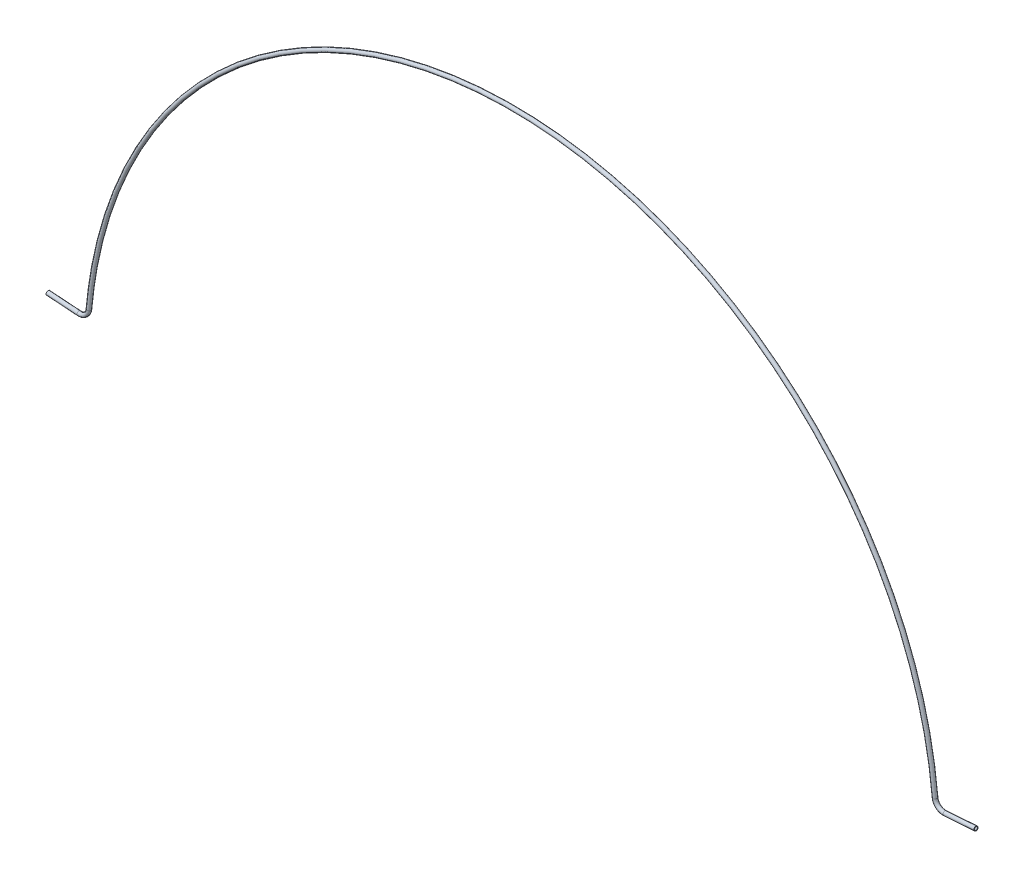
ISO-10303-21;
HEADER;
FILE_DESCRIPTION(('STEP AP214'),'2;1');
FILE_NAME('part.step','',(''),(''),'','','');
FILE_SCHEMA(('AUTOMOTIVE_DESIGN { 1 0 10303 214 1 1 1 1 }'));
ENDSEC;
DATA;
#1=APPLICATION_CONTEXT('core data for automotive mechanical design processes');
#2=APPLICATION_PROTOCOL_DEFINITION('international standard','automotive_design',2000,#1);
#3=PRODUCT_CONTEXT('',#1,'mechanical');
#4=PRODUCT('Part','Part','',(#3));
#5=PRODUCT_RELATED_PRODUCT_CATEGORY('part','',(#4));
#6=PRODUCT_DEFINITION_FORMATION('','',#4);
#7=PRODUCT_DEFINITION_CONTEXT('part definition',#1,'design');
#8=PRODUCT_DEFINITION('design','',#6,#7);
#9=PRODUCT_DEFINITION_SHAPE('','',#8);
#10=(LENGTH_UNIT() NAMED_UNIT(*) SI_UNIT(.MILLI.,.METRE.));
#11=(NAMED_UNIT(*) PLANE_ANGLE_UNIT() SI_UNIT($,.RADIAN.));
#12=(NAMED_UNIT(*) SI_UNIT($,.STERADIAN.) SOLID_ANGLE_UNIT());
#13=UNCERTAINTY_MEASURE_WITH_UNIT(LENGTH_MEASURE(1.E-05),#10,'distance_accuracy_value','');
#14=(GEOMETRIC_REPRESENTATION_CONTEXT(3) GLOBAL_UNCERTAINTY_ASSIGNED_CONTEXT((#13)) GLOBAL_UNIT_ASSIGNED_CONTEXT((#10,
#11,#12)) REPRESENTATION_CONTEXT('',''));
#15=CARTESIAN_POINT('',(0.,0.,0.));
#16=DIRECTION('',(0.,0.,1.));
#17=DIRECTION('',(1.,0.,0.));
#18=AXIS2_PLACEMENT_3D('',#15,#16,#17);
#19=CARTESIAN_POINT('',(512.122941281873,35.8111246069721,0.));
#20=DIRECTION('',(0.997564050259825,0.0697564737441201,0.));
#21=DIRECTION('',(-0.0697564737441187,0.997564050259825,0.));
#22=AXIS2_PLACEMENT_3D('',#19,#20,#21);
#23=CYLINDRICAL_SURFACE('',#22,2.38125000000003);
#24=CARTESIAN_POINT('',(512.122941281873,35.8111246069721,0.));
#25=DIRECTION('',(0.997564050259825,0.0697564737441154,0.));
#26=DIRECTION('',(0.,0.,-1.));
#27=AXIS2_PLACEMENT_3D('',#24,#25,#26);
#28=CIRCLE('',#27,2.38125000000003);
#29=CARTESIAN_POINT('',(512.289048884976,33.4356752122909,0.));
#30=VERTEX_POINT('',#29);
#31=EDGE_CURVE('E55',#30,#30,#28,.T.);
#32=ORIENTED_EDGE('',*,*,#31,.T.);
#33=EDGE_LOOP('',(#32));
#34=FACE_BOUND('',#33,.T.);
#35=CARTESIAN_POINT('',(548.660227642904,38.3660605592659,0.));
#36=DIRECTION('',(0.997564050259825,0.0697564737441154,0.));
#37=DIRECTION('',(0.,0.,-1.));
#38=AXIS2_PLACEMENT_3D('',#35,#36,#37);
#39=CIRCLE('',#38,2.38125000000003);
#40=CARTESIAN_POINT('',(548.660227642904,38.3660605592659,-2.38125000000003));
#41=VERTEX_POINT('',#40);
#42=EDGE_CURVE('E12',#41,#41,#39,.T.);
#43=ORIENTED_EDGE('',*,*,#42,.F.);
#44=EDGE_LOOP('',(#43));
#45=FACE_BOUND('',#44,.T.);
#46=ADVANCED_FACE('F45',(#34,#45),#23,.T.);
#47=CARTESIAN_POINT('',(512.122941281873,35.8111246069721,0.));
#48=DIRECTION('',(0.997564050259825,0.0697564737441201,0.));
#49=DIRECTION('',(-0.0697564737441187,0.997564050259825,0.));
#50=AXIS2_PLACEMENT_3D('',#47,#48,#49);
#51=CYLINDRICAL_SURFACE('',#50,1.67639999999998);
#52=CARTESIAN_POINT('',(512.122941281873,35.8111246069721,0.));
#53=DIRECTION('',(0.997564050259825,0.0697564737441154,0.));
#54=DIRECTION('',(0.,0.,-1.));
#55=AXIS2_PLACEMENT_3D('',#52,#53,#54);
#56=CIRCLE('',#55,1.67639999999998);
#57=CARTESIAN_POINT('',(512.239881034457,34.1388082331166,0.));
#58=VERTEX_POINT('',#57);
#59=EDGE_CURVE('E59',#58,#58,#56,.T.);
#60=ORIENTED_EDGE('',*,*,#59,.F.);
#61=EDGE_LOOP('',(#60));
#62=FACE_BOUND('',#61,.T.);
#63=CARTESIAN_POINT('',(548.660227642904,38.3660605592659,0.));
#64=DIRECTION('',(0.997564050259825,0.0697564737441154,0.));
#65=DIRECTION('',(0.,0.,-1.));
#66=AXIS2_PLACEMENT_3D('',#63,#64,#65);
#67=CIRCLE('',#66,1.67639999999998);
#68=CARTESIAN_POINT('',(548.660227642904,38.3660605592659,-1.67639999999997));
#69=VERTEX_POINT('',#68);
#70=EDGE_CURVE('E51',#69,#69,#67,.T.);
#71=ORIENTED_EDGE('',*,*,#70,.T.);
#72=EDGE_LOOP('',(#71));
#73=FACE_BOUND('',#72,.T.);
#74=ADVANCED_FACE('F113',(#62,#73),#51,.F.);
#75=CARTESIAN_POINT('',(511.347772467391,46.8965551154845,0.));
#76=DIRECTION('',(0.,0.,1.));
#77=DIRECTION('',(1.,0.,0.));
#78=AXIS2_PLACEMENT_3D('',#75,#76,#77);
#79=TOROIDAL_SURFACE('',#78,11.1125,2.38125000000003);
#80=CARTESIAN_POINT('',(500.281713490931,45.8816684324025,0.));
#81=DIRECTION('',(0.0913283854291971,-0.995820830277664,0.));
#82=DIRECTION('',(0.,0.,-1.));
#83=AXIS2_PLACEMENT_3D('',#80,#81,#82);
#84=CIRCLE('',#83,2.38125000000003);
#85=CARTESIAN_POINT('',(497.910415138832,45.6641927145992,0.));
#86=VERTEX_POINT('',#85);
#87=EDGE_CURVE('E64',#86,#86,#84,.T.);
#88=CARTESIAN_POINT('',(511.347772467391,46.8965551154845,0.));
#89=DIRECTION('',(0.,0.,1.));
#90=DIRECTION('',(1.,0.,0.));
#91=AXIS2_PLACEMENT_3D('',#88,#89,#90);
#92=CIRCLE('',#91,13.49375);
#93=EDGE_CURVE('',#86,#30,#92,.T.);
#94=ORIENTED_EDGE('',*,*,#87,.T.);
#95=ORIENTED_EDGE('',*,*,#31,.F.);
#96=ORIENTED_EDGE('',*,*,#93,.T.);
#97=ORIENTED_EDGE('',*,*,#93,.F.);
#98=EDGE_LOOP('',(#94,#96,#95,#97));
#99=FACE_BOUND('',#98,.T.);
#100=ADVANCED_FACE('F106',(#99),#79,.T.);
#101=CARTESIAN_POINT('',(511.347772467391,46.8965551154845,0.));
#102=DIRECTION('',(0.,0.,1.));
#103=DIRECTION('',(1.,0.,0.));
#104=AXIS2_PLACEMENT_3D('',#101,#102,#103);
#105=TOROIDAL_SURFACE('',#104,11.1125,1.67639999999998);
#106=CARTESIAN_POINT('',(500.281713490931,45.8816684324025,0.));
#107=DIRECTION('',(0.0913283854291971,-0.995820830277664,0.));
#108=DIRECTION('',(0.,0.,-1.));
#109=AXIS2_PLACEMENT_3D('',#106,#107,#108);
#110=CIRCLE('',#109,1.67639999999998);
#111=CARTESIAN_POINT('',(498.612319451053,45.728565527069,0.));
#112=VERTEX_POINT('',#111);
#113=EDGE_CURVE('E67',#112,#112,#110,.T.);
#114=CARTESIAN_POINT('',(511.347772467391,46.8965551154845,0.));
#115=DIRECTION('',(0.,0.,1.));
#116=DIRECTION('',(1.,0.,0.));
#117=AXIS2_PLACEMENT_3D('',#114,#115,#116);
#118=CIRCLE('',#117,12.7889);
#119=EDGE_CURVE('',#112,#58,#118,.T.);
#120=ORIENTED_EDGE('',*,*,#113,.F.);
#121=ORIENTED_EDGE('',*,*,#59,.T.);
#122=ORIENTED_EDGE('',*,*,#119,.T.);
#123=ORIENTED_EDGE('',*,*,#119,.F.);
#124=EDGE_LOOP('',(#120,#122,#121,#123));
#125=FACE_BOUND('',#124,.T.);
#126=ADVANCED_FACE('F95',(#125),#105,.F.);
#127=CARTESIAN_POINT('',(0.,0.,0.));
#128=DIRECTION('',(0.,0.,1.));
#129=DIRECTION('',(1.,0.,0.));
#130=AXIS2_PLACEMENT_3D('',#127,#128,#129);
#131=TOROIDAL_SURFACE('',#130,502.38125,1.67639999999998);
#132=ORIENTED_EDGE('',*,*,#113,.T.);
#133=EDGE_LOOP('',(#132));
#134=FACE_BOUND('',#133,.T.);
#135=CARTESIAN_POINT('',(-500.281713490931,45.8816684324018,0.));
#136=DIRECTION('',(0.0913283854291984,0.995820830277664,0.));
#137=DIRECTION('',(0.,0.,-1.));
#138=AXIS2_PLACEMENT_3D('',#135,#136,#137);
#139=CIRCLE('',#138,1.67639999999998);
#140=CARTESIAN_POINT('',(-498.612319451053,45.7285655270683,0.));
#141=VERTEX_POINT('',#140);
#142=EDGE_CURVE('E85',#141,#141,#139,.T.);
#143=ORIENTED_EDGE('',*,*,#142,.F.);
#144=EDGE_LOOP('',(#143));
#145=FACE_BOUND('',#144,.T.);
#146=ADVANCED_FACE('F92',(#134,#145),#131,.F.);
#147=CARTESIAN_POINT('',(0.,0.,0.));
#148=DIRECTION('',(0.,0.,1.));
#149=DIRECTION('',(1.,0.,0.));
#150=AXIS2_PLACEMENT_3D('',#147,#148,#149);
#151=TOROIDAL_SURFACE('',#150,502.38125,2.38125000000003);
#152=ORIENTED_EDGE('',*,*,#87,.F.);
#153=EDGE_LOOP('',(#152));
#154=FACE_BOUND('',#153,.T.);
#155=CARTESIAN_POINT('',(-500.281713490931,45.8816684324018,0.));
#156=DIRECTION('',(0.0913283854291984,0.995820830277664,0.));
#157=DIRECTION('',(0.,0.,-1.));
#158=AXIS2_PLACEMENT_3D('',#155,#156,#157);
#159=CIRCLE('',#158,2.38125000000003);
#160=CARTESIAN_POINT('',(-497.910415138832,45.6641927145985,0.));
#161=VERTEX_POINT('',#160);
#162=EDGE_CURVE('E82',#161,#161,#159,.T.);
#163=ORIENTED_EDGE('',*,*,#162,.T.);
#164=EDGE_LOOP('',(#163));
#165=FACE_BOUND('',#164,.T.);
#166=ADVANCED_FACE('F94',(#154,#165),#151,.T.);
#167=CARTESIAN_POINT('',(548.660227642904,38.3660605592659,0.));
#168=DIRECTION('',(0.997564050259825,0.0697564737441154,0.));
#169=DIRECTION('',(0.,0.,-1.));
#170=AXIS2_PLACEMENT_3D('',#167,#168,#169);
#171=PLANE('',#170);
#172=ORIENTED_EDGE('',*,*,#70,.F.);
#173=EDGE_LOOP('',(#172));
#174=FACE_BOUND('',#173,.T.);
#175=ORIENTED_EDGE('',*,*,#42,.T.);
#176=EDGE_LOOP('',(#175));
#177=FACE_BOUND('',#176,.T.);
#178=ADVANCED_FACE('F98',(#174,#177),#171,.T.);
#179=CARTESIAN_POINT('',(-512.122941281873,35.8111246069714,0.));
#180=DIRECTION('',(-0.997564050259825,0.0697564737441187,0.));
#181=DIRECTION('',(-0.0697564737441201,-0.997564050259825,0.));
#182=AXIS2_PLACEMENT_3D('',#179,#180,#181);
#183=CYLINDRICAL_SURFACE('',#182,2.38125000000003);
#184=CARTESIAN_POINT('',(-512.122941281873,35.8111246069714,0.));
#185=DIRECTION('',(0.997564050259825,-0.0697564737441141,0.));
#186=DIRECTION('',(0.,0.,-1.));
#187=AXIS2_PLACEMENT_3D('',#184,#185,#186);
#188=CIRCLE('',#187,2.38125000000003);
#189=CARTESIAN_POINT('',(-512.289048884976,33.4356752122903,0.));
#190=VERTEX_POINT('',#189);
#191=EDGE_CURVE('E76',#190,#190,#188,.T.);
#192=ORIENTED_EDGE('',*,*,#191,.F.);
#193=EDGE_LOOP('',(#192));
#194=FACE_BOUND('',#193,.T.);
#195=CARTESIAN_POINT('',(-548.660227642904,38.3660605592652,0.));
#196=DIRECTION('',(0.997564050259825,-0.0697564737441141,0.));
#197=DIRECTION('',(0.,0.,-1.));
#198=AXIS2_PLACEMENT_3D('',#195,#196,#197);
#199=CIRCLE('',#198,2.38125000000003);
#200=CARTESIAN_POINT('',(-548.660227642904,38.3660605592652,-2.38125000000003));
#201=VERTEX_POINT('',#200);
#202=EDGE_CURVE('E70',#201,#201,#199,.T.);
#203=ORIENTED_EDGE('',*,*,#202,.T.);
#204=EDGE_LOOP('',(#203));
#205=FACE_BOUND('',#204,.T.);
#206=ADVANCED_FACE('F105',(#194,#205),#183,.T.);
#207=CARTESIAN_POINT('',(-512.122941281873,35.8111246069714,0.));
#208=DIRECTION('',(-0.997564050259825,0.0697564737441187,0.));
#209=DIRECTION('',(-0.0697564737441201,-0.997564050259825,0.));
#210=AXIS2_PLACEMENT_3D('',#207,#208,#209);
#211=CYLINDRICAL_SURFACE('',#210,1.67639999999998);
#212=CARTESIAN_POINT('',(-512.122941281873,35.8111246069714,0.));
#213=DIRECTION('',(0.997564050259825,-0.0697564737441141,0.));
#214=DIRECTION('',(0.,0.,-1.));
#215=AXIS2_PLACEMENT_3D('',#212,#213,#214);
#216=CIRCLE('',#215,1.67639999999998);
#217=CARTESIAN_POINT('',(-512.239881034457,34.138808233116,0.));
#218=VERTEX_POINT('',#217);
#219=EDGE_CURVE('E79',#218,#218,#216,.T.);
#220=ORIENTED_EDGE('',*,*,#219,.T.);
#221=EDGE_LOOP('',(#220));
#222=FACE_BOUND('',#221,.T.);
#223=CARTESIAN_POINT('',(-548.660227642904,38.3660605592652,0.));
#224=DIRECTION('',(0.997564050259825,-0.0697564737441141,0.));
#225=DIRECTION('',(0.,0.,-1.));
#226=AXIS2_PLACEMENT_3D('',#223,#224,#225);
#227=CIRCLE('',#226,1.67639999999998);
#228=CARTESIAN_POINT('',(-548.660227642904,38.3660605592652,-1.67639999999998));
#229=VERTEX_POINT('',#228);
#230=EDGE_CURVE('E73',#229,#229,#227,.T.);
#231=ORIENTED_EDGE('',*,*,#230,.F.);
#232=EDGE_LOOP('',(#231));
#233=FACE_BOUND('',#232,.T.);
#234=ADVANCED_FACE('F134',(#222,#233),#211,.F.);
#235=CARTESIAN_POINT('',(-511.347772467391,46.8965551154838,0.));
#236=DIRECTION('',(0.,0.,-1.));
#237=DIRECTION('',(-1.,0.,0.));
#238=AXIS2_PLACEMENT_3D('',#235,#236,#237);
#239=TOROIDAL_SURFACE('',#238,11.1125,2.38125000000003);
#240=CARTESIAN_POINT('',(-511.347772467391,46.8965551154838,0.));
#241=DIRECTION('',(0.,0.,-1.));
#242=DIRECTION('',(-1.,0.,0.));
#243=AXIS2_PLACEMENT_3D('',#240,#241,#242);
#244=CIRCLE('',#243,13.49375);
#245=EDGE_CURVE('',#161,#190,#244,.T.);
#246=ORIENTED_EDGE('',*,*,#162,.F.);
#247=ORIENTED_EDGE('',*,*,#191,.T.);
#248=ORIENTED_EDGE('',*,*,#245,.T.);
#249=ORIENTED_EDGE('',*,*,#245,.F.);
#250=EDGE_LOOP('',(#246,#248,#247,#249));
#251=FACE_BOUND('',#250,.T.);
#252=ADVANCED_FACE('F131',(#251),#239,.T.);
#253=CARTESIAN_POINT('',(-511.347772467391,46.8965551154838,0.));
#254=DIRECTION('',(0.,0.,-1.));
#255=DIRECTION('',(-1.,0.,0.));
#256=AXIS2_PLACEMENT_3D('',#253,#254,#255);
#257=TOROIDAL_SURFACE('',#256,11.1125,1.67639999999998);
#258=CARTESIAN_POINT('',(-511.347772467391,46.8965551154838,0.));
#259=DIRECTION('',(0.,0.,-1.));
#260=DIRECTION('',(-1.,0.,0.));
#261=AXIS2_PLACEMENT_3D('',#258,#259,#260);
#262=CIRCLE('',#261,12.7889);
#263=EDGE_CURVE('',#141,#218,#262,.T.);
#264=ORIENTED_EDGE('',*,*,#142,.T.);
#265=ORIENTED_EDGE('',*,*,#219,.F.);
#266=ORIENTED_EDGE('',*,*,#263,.T.);
#267=ORIENTED_EDGE('',*,*,#263,.F.);
#268=EDGE_LOOP('',(#264,#266,#265,#267));
#269=FACE_BOUND('',#268,.T.);
#270=ADVANCED_FACE('F89',(#269),#257,.F.);
#271=CARTESIAN_POINT('',(-548.660227642904,38.3660605592652,0.));
#272=DIRECTION('',(-0.997564050259825,0.0697564737441141,0.));
#273=DIRECTION('',(0.,0.,-1.));
#274=AXIS2_PLACEMENT_3D('',#271,#272,#273);
#275=PLANE('',#274);
#276=ORIENTED_EDGE('',*,*,#230,.T.);
#277=EDGE_LOOP('',(#276));
#278=FACE_BOUND('',#277,.T.);
#279=ORIENTED_EDGE('',*,*,#202,.F.);
#280=EDGE_LOOP('',(#279));
#281=FACE_BOUND('',#280,.T.);
#282=ADVANCED_FACE('F143',(#278,#281),#275,.T.);
#283=CLOSED_SHELL('',(#46,#74,#100,#126,#146,#166,#178,#206,#234,#252,#270,#282));
#284=MANIFOLD_SOLID_BREP('B2',#283);
#285=ADVANCED_BREP_SHAPE_REPRESENTATION('',(#18,#284),#14);
#286=SHAPE_DEFINITION_REPRESENTATION(#9,#285);
ENDSEC;
END-ISO-10303-21;
